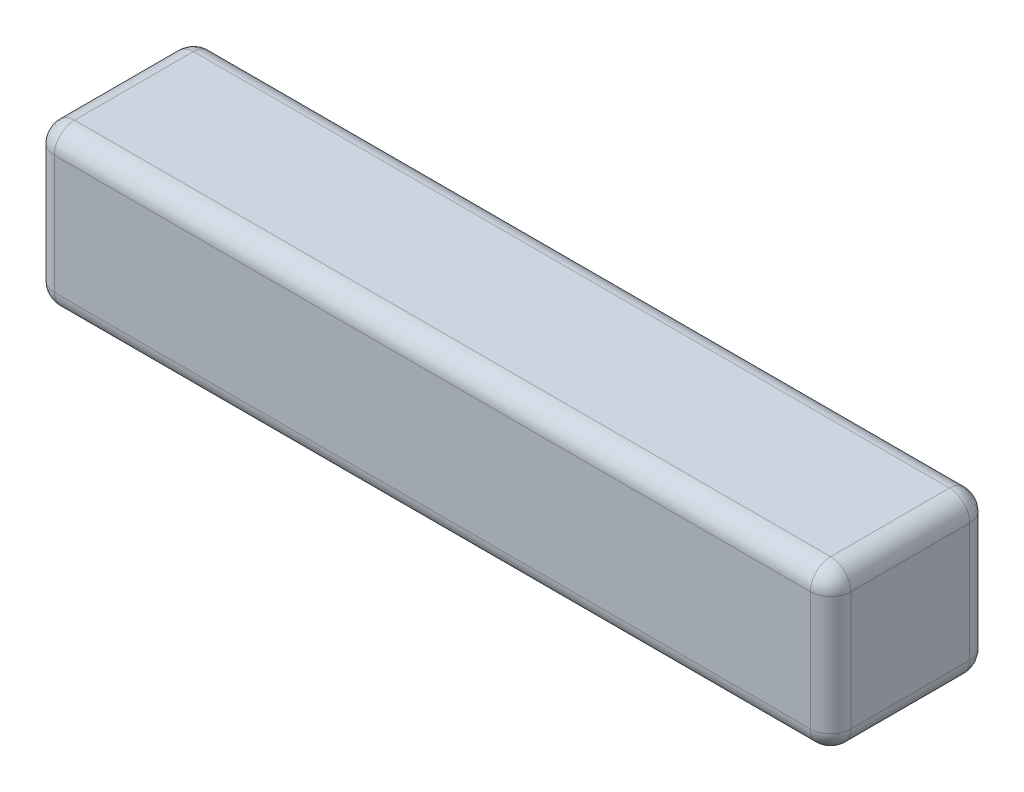
ISO-10303-21;
HEADER;
FILE_DESCRIPTION(('STEP AP214'),'2;1');
FILE_NAME('part.step','',(''),(''),'','','');
FILE_SCHEMA(('AUTOMOTIVE_DESIGN { 1 0 10303 214 1 1 1 1 }'));
ENDSEC;
DATA;
#1=APPLICATION_CONTEXT('core data for automotive mechanical design processes');
#2=APPLICATION_PROTOCOL_DEFINITION('international standard','automotive_design',2000,#1);
#3=PRODUCT_CONTEXT('',#1,'mechanical');
#4=PRODUCT('Part','Part','',(#3));
#5=PRODUCT_RELATED_PRODUCT_CATEGORY('part','',(#4));
#6=PRODUCT_DEFINITION_FORMATION('','',#4);
#7=PRODUCT_DEFINITION_CONTEXT('part definition',#1,'design');
#8=PRODUCT_DEFINITION('design','',#6,#7);
#9=PRODUCT_DEFINITION_SHAPE('','',#8);
#10=(LENGTH_UNIT() NAMED_UNIT(*) SI_UNIT(.MILLI.,.METRE.));
#11=(NAMED_UNIT(*) PLANE_ANGLE_UNIT() SI_UNIT($,.RADIAN.));
#12=(NAMED_UNIT(*) SI_UNIT($,.STERADIAN.) SOLID_ANGLE_UNIT());
#13=UNCERTAINTY_MEASURE_WITH_UNIT(LENGTH_MEASURE(1.E-05),#10,'distance_accuracy_value','');
#14=(GEOMETRIC_REPRESENTATION_CONTEXT(3) GLOBAL_UNCERTAINTY_ASSIGNED_CONTEXT((#13)) GLOBAL_UNIT_ASSIGNED_CONTEXT((#10,
#11,#12)) REPRESENTATION_CONTEXT('',''));
#15=CARTESIAN_POINT('',(0.,0.,0.));
#16=DIRECTION('',(0.,0.,1.));
#17=DIRECTION('',(1.,0.,0.));
#18=AXIS2_PLACEMENT_3D('',#15,#16,#17);
#19=CARTESIAN_POINT('',(9.99999999996,-21.07075011394,-3.746000001));
#20=CARTESIAN_POINT('',(9.99999999996,-20.56275011394,-3.746000001));
#21=CARTESIAN_POINT('',(9.49199999996,-20.56275011394,-3.746000001));
#22=CARTESIAN_POINT('',(9.49199999996,-21.07075011394,-3.746000001));
#23=(BOUNDED_CURVE() B_SPLINE_CURVE(3,(#19,#20,#21,#22),.UNSPECIFIED.,.F.,
.F.) B_SPLINE_CURVE_WITH_KNOTS((4,4),(0.,1.),
.UNSPECIFIED.) CURVE() GEOMETRIC_REPRESENTATION_ITEM() RATIONAL_B_SPLINE_CURVE((1.,
0.333333333333333,0.333333333333333,1.)) REPRESENTATION_ITEM(''));
#24=CARTESIAN_POINT('',(9.74599999996,-21.07075011394,-3.746000001));
#25=DIRECTION('',(-1.,0.,0.));
#26=AXIS1_PLACEMENT('',#24,#25);
#27=SURFACE_OF_REVOLUTION('',#23,#26);
#28=CARTESIAN_POINT('',(9.74599999996,-21.07075011394,-3.74599999846));
#29=DIRECTION('',(0.,0.,-1.));
#30=DIRECTION('',(0.,1.,0.));
#31=AXIS2_PLACEMENT_3D('',#28,#29,#30);
#32=CIRCLE('',#31,0.254000000000001);
#33=CARTESIAN_POINT('',(9.74599999996001,-20.8167501140584,-3.746000000365));
#34=VERTEX_POINT('',#33);
#35=CARTESIAN_POINT('',(9.999999999965,-21.07075011521,-3.74599999973));
#36=VERTEX_POINT('',#35);
#37=EDGE_CURVE('E125',#34,#36,#32,.T.);
#38=ORIENTED_EDGE('',*,*,#37,.T.);
#39=CARTESIAN_POINT('',(9.74599999996,-21.07075011648,-3.746000001));
#40=DIRECTION('',(0.,-1.,0.));
#41=DIRECTION('',(0.,0.,-1.));
#42=AXIS2_PLACEMENT_3D('',#39,#40,#41);
#43=CIRCLE('',#42,0.254);
#44=CARTESIAN_POINT('',(9.74599999996001,-21.0707501161625,-4.00000000075));
#45=VERTEX_POINT('',#44);
#46=EDGE_CURVE('E123',#36,#45,#43,.F.);
#47=ORIENTED_EDGE('',*,*,#46,.T.);
#48=CARTESIAN_POINT('',(9.74599999996,-21.07075011394,-3.746000001));
#49=DIRECTION('',(-1.,0.,0.));
#50=DIRECTION('',(0.,1.,0.));
#51=AXIS2_PLACEMENT_3D('',#48,#49,#50);
#52=CIRCLE('',#51,0.254000000000001);
#53=EDGE_CURVE('E111',#45,#34,#52,.F.);
#54=ORIENTED_EDGE('',*,*,#53,.T.);
#55=EDGE_LOOP('',(#38,#47,#54));
#56=FACE_BOUND('',#55,.T.);
#57=ADVANCED_FACE('F17',(#56),#27,.T.);
#58=CARTESIAN_POINT('',(0.,0.,-4.));
#59=DIRECTION('',(0.,0.,1.));
#60=DIRECTION('',(1.,0.,0.));
#61=AXIS2_PLACEMENT_3D('',#58,#59,#60);
#62=PLANE('',#61);
#63=DIRECTION('',(-1.,0.,0.));
#64=VECTOR('',#63,1.);
#65=CARTESIAN_POINT('',(5.000000000361,-22.56275011444,-4.000000001));
#66=LINE('',#65,#64);
#67=CARTESIAN_POINT('',(9.74599999996001,-22.56275011444,-4.00000000075));
#68=VERTEX_POINT('',#67);
#69=CARTESIAN_POINT('',(0.2540000005715,-22.56275011444,-4.0000000005));
#70=VERTEX_POINT('',#69);
#71=EDGE_CURVE('E345',#68,#70,#66,.T.);
#72=ORIENTED_EDGE('',*,*,#71,.T.);
#73=DIRECTION('',(0.,1.,0.));
#74=VECTOR('',#73,1.);
#75=CARTESIAN_POINT('',(0.254000000762,0.,-4.));
#76=LINE('',#75,#74);
#77=CARTESIAN_POINT('',(0.2540000005715,-21.0707501161625,-4.0000000005));
#78=VERTEX_POINT('',#77);
#79=EDGE_CURVE('E105',#78,#70,#76,.F.);
#80=ORIENTED_EDGE('',*,*,#79,.F.);
#81=DIRECTION('',(1.,0.,0.));
#82=VECTOR('',#81,1.);
#83=CARTESIAN_POINT('',(5.000000000361,-21.07075011648,-4.000000001));
#84=LINE('',#83,#82);
#85=EDGE_CURVE('E114',#78,#45,#84,.T.);
#86=ORIENTED_EDGE('',*,*,#85,.T.);
#87=DIRECTION('',(0.,-1.,0.));
#88=VECTOR('',#87,1.);
#89=CARTESIAN_POINT('',(9.74599999996,-21.81675011546,-4.000000001));
#90=LINE('',#89,#88);
#91=EDGE_CURVE('E133',#45,#68,#90,.T.);
#92=ORIENTED_EDGE('',*,*,#91,.T.);
#93=EDGE_LOOP('',(#72,#80,#86,#92));
#94=FACE_BOUND('',#93,.T.);
#95=ADVANCED_FACE('F139',(#94),#62,.F.);
#96=CARTESIAN_POINT('',(9.74599999996,-22.81675011444,-3.746000001));
#97=CARTESIAN_POINT('',(10.25399999996,-22.81675011444,-3.746000001));
#98=CARTESIAN_POINT('',(10.25399999996,-22.30875011444,-3.746000001));
#99=CARTESIAN_POINT('',(9.74599999996,-22.30875011444,-3.746000001));
#100=(BOUNDED_CURVE() B_SPLINE_CURVE(3,(#96,#97,#98,#99),.UNSPECIFIED.,.F.,
.F.) B_SPLINE_CURVE_WITH_KNOTS((4,4),(0.,1.),
.UNSPECIFIED.) CURVE() GEOMETRIC_REPRESENTATION_ITEM() RATIONAL_B_SPLINE_CURVE((1.,
0.333333333333333,0.333333333333333,1.)) REPRESENTATION_ITEM(''));
#101=CARTESIAN_POINT('',(9.74599999996,-22.56275011444,-3.746000001));
#102=DIRECTION('',(0.,1.,0.));
#103=AXIS1_PLACEMENT('',#101,#102);
#104=SURFACE_OF_REVOLUTION('',#100,#103);
#105=CARTESIAN_POINT('',(9.74599999996,-22.56275011444,-3.74599999846));
#106=DIRECTION('',(0.,0.,1.));
#107=DIRECTION('',(0.,-1.,0.));
#108=AXIS2_PLACEMENT_3D('',#105,#106,#107);
#109=CIRCLE('',#108,0.254000000000001);
#110=CARTESIAN_POINT('',(9.999999999965,-22.56275011444,-3.74599999973));
#111=VERTEX_POINT('',#110);
#112=CARTESIAN_POINT('',(9.74599999996,-22.8167501144959,-3.74599999973));
#113=VERTEX_POINT('',#112);
#114=EDGE_CURVE('E129',#111,#113,#109,.F.);
#115=ORIENTED_EDGE('',*,*,#114,.T.);
#116=CARTESIAN_POINT('',(9.74599999996,-22.56275011444,-3.746000001));
#117=DIRECTION('',(-1.,0.,0.));
#118=DIRECTION('',(0.,0.,-1.));
#119=AXIS2_PLACEMENT_3D('',#116,#117,#118);
#120=CIRCLE('',#119,0.254);
#121=EDGE_CURVE('E340',#113,#68,#120,.F.);
#122=ORIENTED_EDGE('',*,*,#121,.T.);
#123=CARTESIAN_POINT('',(9.74599999996,-22.56275011444,-3.746000001));
#124=DIRECTION('',(0.,-1.,0.));
#125=DIRECTION('',(0.,0.,-1.));
#126=AXIS2_PLACEMENT_3D('',#123,#124,#125);
#127=CIRCLE('',#126,0.254);
#128=EDGE_CURVE('E130',#68,#111,#127,.T.);
#129=ORIENTED_EDGE('',*,*,#128,.T.);
#130=EDGE_LOOP('',(#115,#122,#129));
#131=FACE_BOUND('',#130,.T.);
#132=ADVANCED_FACE('F164',(#131),#104,.T.);
#133=CARTESIAN_POINT('',(0.254,-22.81675011444,-3.746000001));
#134=CARTESIAN_POINT('',(0.254,-22.81675011444,-4.254000001));
#135=CARTESIAN_POINT('',(0.254,-22.30875011444,-4.254000001));
#136=CARTESIAN_POINT('',(0.254,-22.30875011444,-3.746000001));
#137=(BOUNDED_CURVE() B_SPLINE_CURVE(3,(#133,#134,#135,#136),.UNSPECIFIED.,.F.,
.F.) B_SPLINE_CURVE_WITH_KNOTS((4,4),(0.,1.),
.UNSPECIFIED.) CURVE() GEOMETRIC_REPRESENTATION_ITEM() RATIONAL_B_SPLINE_CURVE((1.,
0.333333333333333,0.333333333333333,1.)) REPRESENTATION_ITEM(''));
#138=CARTESIAN_POINT('',(0.254,-22.56275011444,-3.746000001));
#139=DIRECTION('',(0.,1.,0.));
#140=AXIS1_PLACEMENT('',#138,#139);
#141=SURFACE_OF_REVOLUTION('',#137,#140);
#142=CARTESIAN_POINT('',(0.254,-22.56275011444,-3.746000001));
#143=DIRECTION('',(0.,1.,0.));
#144=DIRECTION('',(0.,0.,-1.));
#145=AXIS2_PLACEMENT_3D('',#142,#143,#144);
#146=CIRCLE('',#145,0.254);
#147=CARTESIAN_POINT('',(0.,-22.56275011444,-3.74599999973));
#148=VERTEX_POINT('',#147);
#149=EDGE_CURVE('E329',#148,#70,#146,.F.);
#150=ORIENTED_EDGE('',*,*,#149,.T.);
#151=CARTESIAN_POINT('',(0.254000000762001,-22.56275011444,-3.746000001));
#152=DIRECTION('',(-1.,0.,0.));
#153=DIRECTION('',(0.,0.,-1.));
#154=AXIS2_PLACEMENT_3D('',#151,#152,#153);
#155=CIRCLE('',#154,0.254);
#156=CARTESIAN_POINT('',(0.25400000028575,-22.8167501144959,-3.74599999973));
#157=VERTEX_POINT('',#156);
#158=EDGE_CURVE('E342',#70,#157,#155,.T.);
#159=ORIENTED_EDGE('',*,*,#158,.T.);
#160=CARTESIAN_POINT('',(0.254,-22.56275011444,-3.74599999846));
#161=DIRECTION('',(0.,0.,-1.));
#162=DIRECTION('',(0.,-1.,0.));
#163=AXIS2_PLACEMENT_3D('',#160,#161,#162);
#164=CIRCLE('',#163,0.254000000000001);
#165=EDGE_CURVE('E332',#157,#148,#164,.T.);
#166=ORIENTED_EDGE('',*,*,#165,.T.);
#167=EDGE_LOOP('',(#150,#159,#166));
#168=FACE_BOUND('',#167,.T.);
#169=ADVANCED_FACE('F159',(#168),#141,.T.);
#170=CARTESIAN_POINT('',(0.254,-21.07075011394,-4.000000001));
#171=CARTESIAN_POINT('',(0.254,-20.56275011394,-4.000000001));
#172=CARTESIAN_POINT('',(0.254,-20.56275011394,-3.492000001));
#173=CARTESIAN_POINT('',(0.254,-21.07075011394,-3.492000001));
#174=(BOUNDED_CURVE() B_SPLINE_CURVE(3,(#170,#171,#172,#173),.UNSPECIFIED.,.F.,
.F.) B_SPLINE_CURVE_WITH_KNOTS((4,4),(0.,1.),
.UNSPECIFIED.) CURVE() GEOMETRIC_REPRESENTATION_ITEM() RATIONAL_B_SPLINE_CURVE((1.,
0.333333333333333,0.333333333333333,1.)) REPRESENTATION_ITEM(''));
#175=CARTESIAN_POINT('',(0.254,-21.07075011394,-3.746000001));
#176=DIRECTION('',(0.,0.,1.));
#177=AXIS1_PLACEMENT('',#175,#176);
#178=SURFACE_OF_REVOLUTION('',#174,#177);
#179=CARTESIAN_POINT('',(0.254000000762001,-21.07075011394,-3.746000001));
#180=DIRECTION('',(-1.,0.,0.));
#181=DIRECTION('',(0.,1.,0.));
#182=AXIS2_PLACEMENT_3D('',#179,#180,#181);
#183=CIRCLE('',#182,0.254000000000001);
#184=CARTESIAN_POINT('',(0.2540000001905,-20.8167501140584,-3.7460000006825));
#185=VERTEX_POINT('',#184);
#186=EDGE_CURVE('E121',#185,#78,#183,.T.);
#187=ORIENTED_EDGE('',*,*,#186,.T.);
#188=CARTESIAN_POINT('',(0.254,-21.07075011648,-3.746000001));
#189=DIRECTION('',(0.,1.,0.));
#190=DIRECTION('',(0.,0.,-1.));
#191=AXIS2_PLACEMENT_3D('',#188,#189,#190);
#192=CIRCLE('',#191,0.254);
#193=CARTESIAN_POINT('',(0.,-21.07075011521,-3.746000000365));
#194=VERTEX_POINT('',#193);
#195=EDGE_CURVE('E326',#78,#194,#192,.T.);
#196=ORIENTED_EDGE('',*,*,#195,.T.);
#197=CARTESIAN_POINT('',(0.254,-21.07075011394,-3.746000001));
#198=DIRECTION('',(0.,0.,1.));
#199=DIRECTION('',(0.,1.,0.));
#200=AXIS2_PLACEMENT_3D('',#197,#198,#199);
#201=CIRCLE('',#200,0.254000000000001);
#202=EDGE_CURVE('E337',#194,#185,#201,.F.);
#203=ORIENTED_EDGE('',*,*,#202,.T.);
#204=EDGE_LOOP('',(#187,#196,#203));
#205=FACE_BOUND('',#204,.T.);
#206=ADVANCED_FACE('F155',(#205),#178,.T.);
#207=CARTESIAN_POINT('',(9.74599999996,-21.07075011394,-3.746000001));
#208=DIRECTION('',(-1.,0.,0.));
#209=DIRECTION('',(0.,0.,1.));
#210=AXIS2_PLACEMENT_3D('',#207,#208,#209);
#211=CYLINDRICAL_SURFACE('',#210,0.254000000000001);
#212=DIRECTION('',(1.,0.,0.));
#213=VECTOR('',#212,1.);
#214=CARTESIAN_POINT('',(0.,-20.8167501148869,-3.74599999846));
#215=LINE('',#214,#213);
#216=EDGE_CURVE('E117',#185,#34,#215,.T.);
#217=ORIENTED_EDGE('',*,*,#216,.T.);
#218=ORIENTED_EDGE('',*,*,#53,.F.);
#219=ORIENTED_EDGE('',*,*,#85,.F.);
#220=ORIENTED_EDGE('',*,*,#186,.F.);
#221=EDGE_LOOP('',(#217,#218,#219,#220));
#222=FACE_BOUND('',#221,.T.);
#223=ADVANCED_FACE('F113',(#222),#211,.T.);
#224=CARTESIAN_POINT('',(9.74599999996,-21.07075011394,-2.253999999992));
#225=DIRECTION('',(0.,0.,-1.));
#226=DIRECTION('',(-1.,0.,0.));
#227=AXIS2_PLACEMENT_3D('',#224,#225,#226);
#228=CYLINDRICAL_SURFACE('',#227,0.254000000000001);
#229=DIRECTION('',(0.,0.,-1.));
#230=VECTOR('',#229,1.);
#231=CARTESIAN_POINT('',(10.,-21.07075011648,0.));
#232=LINE('',#231,#230);
#233=CARTESIAN_POINT('',(9.99999999997,-21.0707501161625,-2.25400000027775));
#234=VERTEX_POINT('',#233);
#235=EDGE_CURVE('E313',#234,#36,#232,.T.);
#236=ORIENTED_EDGE('',*,*,#235,.T.);
#237=ORIENTED_EDGE('',*,*,#37,.F.);
#238=DIRECTION('',(0.,0.,-1.));
#239=VECTOR('',#238,1.);
#240=CARTESIAN_POINT('',(9.74599999996,-20.8167501148869,0.));
#241=LINE('',#240,#239);
#242=CARTESIAN_POINT('',(9.74599999996,-20.8167501141767,-2.25400000027775));
#243=VERTEX_POINT('',#242);
#244=EDGE_CURVE('E318',#34,#243,#241,.F.);
#245=ORIENTED_EDGE('',*,*,#244,.T.);
#246=CARTESIAN_POINT('',(9.74599999996,-21.07075011394,-2.253999999992));
#247=DIRECTION('',(0.,0.,-1.));
#248=DIRECTION('',(0.,1.,0.));
#249=AXIS2_PLACEMENT_3D('',#246,#247,#248);
#250=CIRCLE('',#249,0.254000000000001);
#251=EDGE_CURVE('E137',#234,#243,#250,.F.);
#252=ORIENTED_EDGE('',*,*,#251,.F.);
#253=EDGE_LOOP('',(#236,#237,#245,#252));
#254=FACE_BOUND('',#253,.T.);
#255=ADVANCED_FACE('F305',(#254),#228,.T.);
#256=CARTESIAN_POINT('',(9.74599999996,-21.07075011648,-3.746000001));
#257=DIRECTION('',(0.,-1.,0.));
#258=DIRECTION('',(0.,0.,-1.));
#259=AXIS2_PLACEMENT_3D('',#256,#257,#258);
#260=CYLINDRICAL_SURFACE('',#259,0.254);
#261=DIRECTION('',(0.,1.,0.));
#262=VECTOR('',#261,1.);
#263=CARTESIAN_POINT('',(10.,0.,-3.74599999846));
#264=LINE('',#263,#262);
#265=EDGE_CURVE('E317',#36,#111,#264,.F.);
#266=ORIENTED_EDGE('',*,*,#265,.T.);
#267=ORIENTED_EDGE('',*,*,#128,.F.);
#268=ORIENTED_EDGE('',*,*,#91,.F.);
#269=ORIENTED_EDGE('',*,*,#46,.F.);
#270=EDGE_LOOP('',(#266,#267,#268,#269));
#271=FACE_BOUND('',#270,.T.);
#272=ADVANCED_FACE('F134',(#271),#260,.T.);
#273=CARTESIAN_POINT('',(9.74599999996,-22.56275011444,-3.74599999846));
#274=DIRECTION('',(0.,0.,1.));
#275=DIRECTION('',(1.,0.,0.));
#276=AXIS2_PLACEMENT_3D('',#273,#274,#275);
#277=CYLINDRICAL_SURFACE('',#276,0.254000000000001);
#278=DIRECTION('',(0.,0.,1.));
#279=VECTOR('',#278,1.);
#280=CARTESIAN_POINT('',(9.74599999996,-22.8167501148869,0.));
#281=LINE('',#280,#279);
#282=CARTESIAN_POINT('',(9.74599999996,-22.8167501145517,-2.2540000005635));
#283=VERTEX_POINT('',#282);
#284=EDGE_CURVE('E260',#283,#113,#281,.F.);
#285=ORIENTED_EDGE('',*,*,#284,.T.);
#286=ORIENTED_EDGE('',*,*,#114,.F.);
#287=DIRECTION('',(0.,0.,-1.));
#288=VECTOR('',#287,1.);
#289=CARTESIAN_POINT('',(10.,-22.56275011444,0.));
#290=LINE('',#289,#288);
#291=CARTESIAN_POINT('',(9.99999999997,-22.56275011444,-2.25400000065875));
#292=VERTEX_POINT('',#291);
#293=EDGE_CURVE('E263',#111,#292,#290,.F.);
#294=ORIENTED_EDGE('',*,*,#293,.T.);
#295=CARTESIAN_POINT('',(9.74599999996,-22.56275011444,-2.254000000754));
#296=DIRECTION('',(0.,0.,1.));
#297=DIRECTION('',(0.,-1.,0.));
#298=AXIS2_PLACEMENT_3D('',#295,#296,#297);
#299=CIRCLE('',#298,0.254000000000001);
#300=EDGE_CURVE('E347',#283,#292,#299,.T.);
#301=ORIENTED_EDGE('',*,*,#300,.F.);
#302=EDGE_LOOP('',(#285,#286,#294,#301));
#303=FACE_BOUND('',#302,.T.);
#304=ADVANCED_FACE('F299',(#303),#277,.T.);
#305=CARTESIAN_POINT('',(9.74599999996,-22.56275011444,-3.746000001));
#306=DIRECTION('',(-1.,0.,0.));
#307=DIRECTION('',(0.,0.,1.));
#308=AXIS2_PLACEMENT_3D('',#305,#306,#307);
#309=CYLINDRICAL_SURFACE('',#308,0.254);
#310=DIRECTION('',(1.,0.,0.));
#311=VECTOR('',#310,1.);
#312=CARTESIAN_POINT('',(0.,-22.8167501148869,-3.74599999846));
#313=LINE('',#312,#311);
#314=EDGE_CURVE('E257',#113,#157,#313,.F.);
#315=ORIENTED_EDGE('',*,*,#314,.T.);
#316=ORIENTED_EDGE('',*,*,#158,.F.);
#317=ORIENTED_EDGE('',*,*,#71,.F.);
#318=ORIENTED_EDGE('',*,*,#121,.F.);
#319=EDGE_LOOP('',(#315,#316,#317,#318));
#320=FACE_BOUND('',#319,.T.);
#321=ADVANCED_FACE('F295',(#320),#309,.T.);
#322=CARTESIAN_POINT('',(0.254,-21.07075011394,-3.746000001));
#323=DIRECTION('',(0.,0.,1.));
#324=DIRECTION('',(1.,0.,0.));
#325=AXIS2_PLACEMENT_3D('',#322,#323,#324);
#326=CYLINDRICAL_SURFACE('',#325,0.254000000000001);
#327=DIRECTION('',(0.,0.,-1.));
#328=VECTOR('',#327,1.);
#329=CARTESIAN_POINT('',(0.254000000762,-20.8167501148869,0.));
#330=LINE('',#329,#328);
#331=CARTESIAN_POINT('',(0.2540000001905,-20.8167501140584,-2.2540000005635));
#332=VERTEX_POINT('',#331);
#333=EDGE_CURVE('E323',#332,#185,#330,.T.);
#334=ORIENTED_EDGE('',*,*,#333,.T.);
#335=ORIENTED_EDGE('',*,*,#202,.F.);
#336=DIRECTION('',(0.,0.,-1.));
#337=VECTOR('',#336,1.);
#338=CARTESIAN_POINT('',(0.,-21.07075011648,0.));
#339=LINE('',#338,#337);
#340=CARTESIAN_POINT('',(0.,-21.0707501161625,-2.25400000065875));
#341=VERTEX_POINT('',#340);
#342=EDGE_CURVE('E225',#194,#341,#339,.F.);
#343=ORIENTED_EDGE('',*,*,#342,.T.);
#344=CARTESIAN_POINT('',(0.254,-21.07075011394,-2.254000000754));
#345=DIRECTION('',(0.,0.,1.));
#346=DIRECTION('',(0.,1.,0.));
#347=AXIS2_PLACEMENT_3D('',#344,#345,#346);
#348=CIRCLE('',#347,0.254000000000001);
#349=EDGE_CURVE('E335',#332,#341,#348,.T.);
#350=ORIENTED_EDGE('',*,*,#349,.F.);
#351=EDGE_LOOP('',(#334,#335,#343,#350));
#352=FACE_BOUND('',#351,.T.);
#353=ADVANCED_FACE('F291',(#352),#326,.T.);
#354=CARTESIAN_POINT('',(0.254,-22.56275011444,-2.254000000754));
#355=DIRECTION('',(0.,0.,-1.));
#356=DIRECTION('',(-1.,0.,0.));
#357=AXIS2_PLACEMENT_3D('',#354,#355,#356);
#358=CYLINDRICAL_SURFACE('',#357,0.254000000000001);
#359=DIRECTION('',(0.,0.,-1.));
#360=VECTOR('',#359,1.);
#361=CARTESIAN_POINT('',(0.,-22.56275011444,0.));
#362=LINE('',#361,#360);
#363=CARTESIAN_POINT('',(0.,-22.56275011444,-2.2540000005635));
#364=VERTEX_POINT('',#363);
#365=EDGE_CURVE('E222',#364,#148,#362,.T.);
#366=ORIENTED_EDGE('',*,*,#365,.T.);
#367=ORIENTED_EDGE('',*,*,#165,.F.);
#368=DIRECTION('',(0.,0.,1.));
#369=VECTOR('',#368,1.);
#370=CARTESIAN_POINT('',(0.254000000762,-22.8167501148869,0.));
#371=LINE('',#370,#369);
#372=CARTESIAN_POINT('',(0.25400000028575,-22.8167501145517,-2.2540000005635));
#373=VERTEX_POINT('',#372);
#374=EDGE_CURVE('E251',#157,#373,#371,.T.);
#375=ORIENTED_EDGE('',*,*,#374,.T.);
#376=CARTESIAN_POINT('',(0.254,-22.56275011444,-2.253999999992));
#377=DIRECTION('',(0.,0.,-1.));
#378=DIRECTION('',(-1.,0.,0.));
#379=AXIS2_PLACEMENT_3D('',#376,#377,#378);
#380=CIRCLE('',#379,0.254000000000001);
#381=EDGE_CURVE('E228',#373,#364,#380,.T.);
#382=ORIENTED_EDGE('',*,*,#381,.T.);
#383=EDGE_LOOP('',(#366,#367,#375,#382));
#384=FACE_BOUND('',#383,.T.);
#385=ADVANCED_FACE('F287',(#384),#358,.T.);
#386=CARTESIAN_POINT('',(0.254,-22.56275011444,-3.746000001));
#387=DIRECTION('',(0.,1.,0.));
#388=DIRECTION('',(0.,0.,1.));
#389=AXIS2_PLACEMENT_3D('',#386,#387,#388);
#390=CYLINDRICAL_SURFACE('',#389,0.254);
#391=ORIENTED_EDGE('',*,*,#79,.T.);
#392=ORIENTED_EDGE('',*,*,#149,.F.);
#393=DIRECTION('',(0.,1.,0.));
#394=VECTOR('',#393,1.);
#395=CARTESIAN_POINT('',(0.,0.,-3.74599999846));
#396=LINE('',#395,#394);
#397=EDGE_CURVE('E216',#148,#194,#396,.T.);
#398=ORIENTED_EDGE('',*,*,#397,.T.);
#399=ORIENTED_EDGE('',*,*,#195,.F.);
#400=EDGE_LOOP('',(#391,#392,#398,#399));
#401=FACE_BOUND('',#400,.T.);
#402=ADVANCED_FACE('F283',(#401),#390,.T.);
#403=CARTESIAN_POINT('',(0.,-20.8167501148869,0.));
#404=DIRECTION('',(0.,-1.,0.));
#405=DIRECTION('',(0.,0.,-1.));
#406=AXIS2_PLACEMENT_3D('',#403,#404,#405);
#407=PLANE('',#406);
#408=ORIENTED_EDGE('',*,*,#216,.F.);
#409=ORIENTED_EDGE('',*,*,#333,.F.);
#410=DIRECTION('',(1.,0.,0.));
#411=VECTOR('',#410,1.);
#412=CARTESIAN_POINT('',(5.000000000361,-20.81675011394,-2.254000000754));
#413=LINE('',#412,#411);
#414=EDGE_CURVE('E364',#332,#243,#413,.T.);
#415=ORIENTED_EDGE('',*,*,#414,.T.);
#416=ORIENTED_EDGE('',*,*,#244,.F.);
#417=EDGE_LOOP('',(#408,#409,#415,#416));
#418=FACE_BOUND('',#417,.T.);
#419=ADVANCED_FACE('F279',(#418),#407,.F.);
#420=CARTESIAN_POINT('',(10.,0.,0.));
#421=DIRECTION('',(1.,0.,0.));
#422=DIRECTION('',(0.,0.,-1.));
#423=AXIS2_PLACEMENT_3D('',#420,#421,#422);
#424=PLANE('',#423);
#425=ORIENTED_EDGE('',*,*,#265,.F.);
#426=ORIENTED_EDGE('',*,*,#235,.F.);
#427=DIRECTION('',(0.,-1.,0.));
#428=VECTOR('',#427,1.);
#429=CARTESIAN_POINT('',(9.99999999996,-21.81675011546,-2.254000000754));
#430=LINE('',#429,#428);
#431=EDGE_CURVE('E367',#234,#292,#430,.T.);
#432=ORIENTED_EDGE('',*,*,#431,.T.);
#433=ORIENTED_EDGE('',*,*,#293,.F.);
#434=EDGE_LOOP('',(#425,#426,#432,#433));
#435=FACE_BOUND('',#434,.T.);
#436=ADVANCED_FACE('F275',(#435),#424,.T.);
#437=CARTESIAN_POINT('',(9.74599999996,-21.07075011394,-1.999999999992));
#438=CARTESIAN_POINT('',(9.74599999996,-20.56275011394,-1.999999999992));
#439=CARTESIAN_POINT('',(9.74599999996,-20.56275011394,-2.507999999992));
#440=CARTESIAN_POINT('',(9.74599999996,-21.07075011394,-2.507999999992));
#441=(BOUNDED_CURVE() B_SPLINE_CURVE(3,(#437,#438,#439,#440),.UNSPECIFIED.,.F.,
.F.) B_SPLINE_CURVE_WITH_KNOTS((4,4),(0.,1.),
.UNSPECIFIED.) CURVE() GEOMETRIC_REPRESENTATION_ITEM() RATIONAL_B_SPLINE_CURVE((1.,
0.333333333333333,0.333333333333333,1.)) REPRESENTATION_ITEM(''));
#442=CARTESIAN_POINT('',(9.74599999996,-21.07075011394,-2.253999999992));
#443=DIRECTION('',(0.,0.,-1.));
#444=AXIS1_PLACEMENT('',#442,#443);
#445=SURFACE_OF_REVOLUTION('',#441,#444);
#446=CARTESIAN_POINT('',(9.74599999996,-21.07075011394,-2.253999999992));
#447=DIRECTION('',(-1.,0.,0.));
#448=DIRECTION('',(0.,0.,1.));
#449=AXIS2_PLACEMENT_3D('',#446,#447,#448);
#450=CIRCLE('',#449,0.254);
#451=CARTESIAN_POINT('',(9.74599999996,-21.070750114575,-1.999999999993));
#452=VERTEX_POINT('',#451);
#453=EDGE_CURVE('E365',#243,#452,#450,.F.);
#454=ORIENTED_EDGE('',*,*,#453,.T.);
#455=CARTESIAN_POINT('',(9.74599999996,-21.07075011648,-2.253999999992));
#456=DIRECTION('',(0.,1.,0.));
#457=DIRECTION('',(0.,0.,1.));
#458=AXIS2_PLACEMENT_3D('',#455,#456,#457);
#459=CIRCLE('',#458,0.254);
#460=EDGE_CURVE('E374',#452,#234,#459,.T.);
#461=ORIENTED_EDGE('',*,*,#460,.T.);
#462=ORIENTED_EDGE('',*,*,#251,.T.);
#463=EDGE_LOOP('',(#454,#461,#462));
#464=FACE_BOUND('',#463,.T.);
#465=ADVANCED_FACE('F272',(#464),#445,.T.);
#466=CARTESIAN_POINT('',(0.,-22.8167501148869,0.));
#467=DIRECTION('',(0.,1.,0.));
#468=DIRECTION('',(0.,0.,1.));
#469=AXIS2_PLACEMENT_3D('',#466,#467,#468);
#470=PLANE('',#469);
#471=ORIENTED_EDGE('',*,*,#314,.F.);
#472=ORIENTED_EDGE('',*,*,#284,.F.);
#473=DIRECTION('',(-1.,0.,0.));
#474=VECTOR('',#473,1.);
#475=CARTESIAN_POINT('',(5.000000000361,-22.81675011444,-2.253999999992));
#476=LINE('',#475,#474);
#477=EDGE_CURVE('E377',#283,#373,#476,.T.);
#478=ORIENTED_EDGE('',*,*,#477,.T.);
#479=ORIENTED_EDGE('',*,*,#374,.F.);
#480=EDGE_LOOP('',(#471,#472,#478,#479));
#481=FACE_BOUND('',#480,.T.);
#482=ADVANCED_FACE('F244',(#481),#470,.F.);
#483=CARTESIAN_POINT('',(9.74599999996,-22.81675011444,-2.253999999992));
#484=CARTESIAN_POINT('',(9.74599999996,-22.81675011444,-1.745999999992));
#485=CARTESIAN_POINT('',(9.74599999996,-22.30875011444,-1.745999999992));
#486=CARTESIAN_POINT('',(9.74599999996,-22.30875011444,-2.253999999992));
#487=(BOUNDED_CURVE() B_SPLINE_CURVE(3,(#483,#484,#485,#486),.UNSPECIFIED.,.F.,
.F.) B_SPLINE_CURVE_WITH_KNOTS((4,4),(0.,1.),
.UNSPECIFIED.) CURVE() GEOMETRIC_REPRESENTATION_ITEM() RATIONAL_B_SPLINE_CURVE((1.,
0.333333333333333,0.333333333333333,1.)) REPRESENTATION_ITEM(''));
#488=CARTESIAN_POINT('',(9.74599999996,-22.56275011444,-2.253999999992));
#489=DIRECTION('',(0.,1.,0.));
#490=AXIS1_PLACEMENT('',#488,#489);
#491=SURFACE_OF_REVOLUTION('',#487,#490);
#492=CARTESIAN_POINT('',(9.74599999996,-22.56275011444,-2.253999999992));
#493=DIRECTION('',(-1.,0.,0.));
#494=DIRECTION('',(0.,-1.,0.));
#495=AXIS2_PLACEMENT_3D('',#492,#493,#494);
#496=CIRCLE('',#495,0.254000000000001);
#497=CARTESIAN_POINT('',(9.74599999996,-22.56275011444,-1.999999999993));
#498=VERTEX_POINT('',#497);
#499=EDGE_CURVE('E382',#498,#283,#496,.F.);
#500=ORIENTED_EDGE('',*,*,#499,.T.);
#501=ORIENTED_EDGE('',*,*,#300,.T.);
#502=CARTESIAN_POINT('',(9.74599999996,-22.56275011444,-2.253999999992));
#503=DIRECTION('',(0.,1.,0.));
#504=DIRECTION('',(0.,0.,1.));
#505=AXIS2_PLACEMENT_3D('',#502,#503,#504);
#506=CIRCLE('',#505,0.254);
#507=EDGE_CURVE('E371',#292,#498,#506,.F.);
#508=ORIENTED_EDGE('',*,*,#507,.T.);
#509=EDGE_LOOP('',(#500,#501,#508));
#510=FACE_BOUND('',#509,.T.);
#511=ADVANCED_FACE('F240',(#510),#491,.T.);
#512=CARTESIAN_POINT('',(0.254,-22.81675011444,-2.253999999992));
#513=CARTESIAN_POINT('',(-0.254000000000001,-22.81675011444,-2.253999999992));
#514=CARTESIAN_POINT('',(-0.254000000000001,-22.30875011444,-2.253999999992));
#515=CARTESIAN_POINT('',(0.254,-22.30875011444,-2.253999999992));
#516=(BOUNDED_CURVE() B_SPLINE_CURVE(3,(#512,#513,#514,#515),.UNSPECIFIED.,.F.,
.F.) B_SPLINE_CURVE_WITH_KNOTS((4,4),(0.,1.),
.UNSPECIFIED.) CURVE() GEOMETRIC_REPRESENTATION_ITEM() RATIONAL_B_SPLINE_CURVE((1.,
0.333333333333333,0.333333333333333,1.)) REPRESENTATION_ITEM(''));
#517=CARTESIAN_POINT('',(0.254,-22.56275011444,-2.253999999992));
#518=DIRECTION('',(0.,1.,0.));
#519=AXIS1_PLACEMENT('',#517,#518);
#520=SURFACE_OF_REVOLUTION('',#516,#519);
#521=CARTESIAN_POINT('',(0.254,-22.56275011444,-2.253999999992));
#522=DIRECTION('',(0.,-1.,0.));
#523=DIRECTION('',(0.,0.,1.));
#524=AXIS2_PLACEMENT_3D('',#521,#522,#523);
#525=CIRCLE('',#524,0.254);
#526=CARTESIAN_POINT('',(0.25400000028575,-22.56275011444,-1.999999999993));
#527=VERTEX_POINT('',#526);
#528=EDGE_CURVE('E36',#527,#364,#525,.T.);
#529=ORIENTED_EDGE('',*,*,#528,.T.);
#530=ORIENTED_EDGE('',*,*,#381,.F.);
#531=CARTESIAN_POINT('',(0.254000000762001,-22.56275011444,-2.253999999992));
#532=DIRECTION('',(-1.,0.,0.));
#533=DIRECTION('',(0.,-1.,0.));
#534=AXIS2_PLACEMENT_3D('',#531,#532,#533);
#535=CIRCLE('',#534,0.254000000000001);
#536=EDGE_CURVE('E380',#373,#527,#535,.T.);
#537=ORIENTED_EDGE('',*,*,#536,.T.);
#538=EDGE_LOOP('',(#529,#530,#537));
#539=FACE_BOUND('',#538,.T.);
#540=ADVANCED_FACE('F237',(#539),#520,.T.);
#541=CARTESIAN_POINT('',(0.,0.,0.));
#542=DIRECTION('',(1.,0.,0.));
#543=DIRECTION('',(0.,0.,-1.));
#544=AXIS2_PLACEMENT_3D('',#541,#542,#543);
#545=PLANE('',#544);
#546=ORIENTED_EDGE('',*,*,#365,.F.);
#547=DIRECTION('',(0.,1.,0.));
#548=VECTOR('',#547,1.);
#549=CARTESIAN_POINT('',(0.,-21.81675011419,-2.254000000754));
#550=LINE('',#549,#548);
#551=EDGE_CURVE('E386',#364,#341,#550,.T.);
#552=ORIENTED_EDGE('',*,*,#551,.T.);
#553=ORIENTED_EDGE('',*,*,#342,.F.);
#554=ORIENTED_EDGE('',*,*,#397,.F.);
#555=EDGE_LOOP('',(#546,#552,#553,#554));
#556=FACE_BOUND('',#555,.T.);
#557=ADVANCED_FACE('F206',(#556),#545,.F.);
#558=CARTESIAN_POINT('',(0.,-21.07075011394,-2.253999999992));
#559=CARTESIAN_POINT('',(0.,-20.56275011394,-2.253999999992));
#560=CARTESIAN_POINT('',(0.508,-20.56275011394,-2.253999999992));
#561=CARTESIAN_POINT('',(0.508,-21.07075011394,-2.253999999992));
#562=(BOUNDED_CURVE() B_SPLINE_CURVE(3,(#558,#559,#560,#561),.UNSPECIFIED.,.F.,
.F.) B_SPLINE_CURVE_WITH_KNOTS((4,4),(0.,1.),
.UNSPECIFIED.) CURVE() GEOMETRIC_REPRESENTATION_ITEM() RATIONAL_B_SPLINE_CURVE((1.,
0.333333333333333,0.333333333333333,1.)) REPRESENTATION_ITEM(''));
#563=CARTESIAN_POINT('',(0.254,-21.07075011394,-2.253999999992));
#564=DIRECTION('',(1.,0.,0.));
#565=AXIS1_PLACEMENT('',#563,#564);
#566=SURFACE_OF_REVOLUTION('',#562,#565);
#567=CARTESIAN_POINT('',(0.254000000762001,-21.07075011394,-2.253999999992));
#568=DIRECTION('',(-1.,0.,0.));
#569=DIRECTION('',(0.,0.,1.));
#570=AXIS2_PLACEMENT_3D('',#567,#568,#569);
#571=CIRCLE('',#570,0.254);
#572=CARTESIAN_POINT('',(0.25400000028575,-21.070750114575,-1.999999999993));
#573=VERTEX_POINT('',#572);
#574=EDGE_CURVE('E214',#573,#332,#571,.T.);
#575=ORIENTED_EDGE('',*,*,#574,.T.);
#576=ORIENTED_EDGE('',*,*,#349,.T.);
#577=CARTESIAN_POINT('',(0.254,-21.07075011648,-2.253999999992));
#578=DIRECTION('',(0.,-1.,0.));
#579=DIRECTION('',(0.,0.,1.));
#580=AXIS2_PLACEMENT_3D('',#577,#578,#579);
#581=CIRCLE('',#580,0.254);
#582=EDGE_CURVE('E361',#341,#573,#581,.F.);
#583=ORIENTED_EDGE('',*,*,#582,.T.);
#584=EDGE_LOOP('',(#575,#576,#583));
#585=FACE_BOUND('',#584,.T.);
#586=ADVANCED_FACE('F201',(#585),#566,.T.);
#587=CARTESIAN_POINT('',(9.74599999996,-21.07075011394,-2.253999999992));
#588=DIRECTION('',(-1.,0.,0.));
#589=DIRECTION('',(0.,0.,1.));
#590=AXIS2_PLACEMENT_3D('',#587,#588,#589);
#591=CYLINDRICAL_SURFACE('',#590,0.254);
#592=ORIENTED_EDGE('',*,*,#414,.F.);
#593=ORIENTED_EDGE('',*,*,#574,.F.);
#594=DIRECTION('',(-1.,0.,0.));
#595=VECTOR('',#594,1.);
#596=CARTESIAN_POINT('',(0.,-21.07075011648,-2.));
#597=LINE('',#596,#595);
#598=EDGE_CURVE('E390',#573,#452,#597,.F.);
#599=ORIENTED_EDGE('',*,*,#598,.T.);
#600=ORIENTED_EDGE('',*,*,#453,.F.);
#601=EDGE_LOOP('',(#592,#593,#599,#600));
#602=FACE_BOUND('',#601,.T.);
#603=ADVANCED_FACE('F197',(#602),#591,.T.);
#604=CARTESIAN_POINT('',(9.74599999996,-22.56275011444,-2.253999999992));
#605=DIRECTION('',(0.,1.,0.));
#606=DIRECTION('',(0.,0.,1.));
#607=AXIS2_PLACEMENT_3D('',#604,#605,#606);
#608=CYLINDRICAL_SURFACE('',#607,0.254);
#609=DIRECTION('',(0.,1.,0.));
#610=VECTOR('',#609,1.);
#611=CARTESIAN_POINT('',(9.74599999996,0.,-2.));
#612=LINE('',#611,#610);
#613=EDGE_CURVE('E392',#452,#498,#612,.F.);
#614=ORIENTED_EDGE('',*,*,#613,.T.);
#615=ORIENTED_EDGE('',*,*,#507,.F.);
#616=ORIENTED_EDGE('',*,*,#431,.F.);
#617=ORIENTED_EDGE('',*,*,#460,.F.);
#618=EDGE_LOOP('',(#614,#615,#616,#617));
#619=FACE_BOUND('',#618,.T.);
#620=ADVANCED_FACE('F193',(#619),#608,.T.);
#621=CARTESIAN_POINT('',(9.74599999996,-22.56275011444,-2.253999999992));
#622=DIRECTION('',(-1.,0.,0.));
#623=DIRECTION('',(0.,0.,1.));
#624=AXIS2_PLACEMENT_3D('',#621,#622,#623);
#625=CYLINDRICAL_SURFACE('',#624,0.254000000000001);
#626=DIRECTION('',(-1.,0.,0.));
#627=VECTOR('',#626,1.);
#628=CARTESIAN_POINT('',(0.,-22.56275011444,-2.));
#629=LINE('',#628,#627);
#630=EDGE_CURVE('E28',#498,#527,#629,.T.);
#631=ORIENTED_EDGE('',*,*,#630,.T.);
#632=ORIENTED_EDGE('',*,*,#536,.F.);
#633=ORIENTED_EDGE('',*,*,#477,.F.);
#634=ORIENTED_EDGE('',*,*,#499,.F.);
#635=EDGE_LOOP('',(#631,#632,#633,#634));
#636=FACE_BOUND('',#635,.T.);
#637=ADVANCED_FACE('F187',(#636),#625,.T.);
#638=CARTESIAN_POINT('',(0.254,-21.07075011394,-2.253999999992));
#639=DIRECTION('',(0.,-1.,0.));
#640=DIRECTION('',(0.,0.,-1.));
#641=AXIS2_PLACEMENT_3D('',#638,#639,#640);
#642=CYLINDRICAL_SURFACE('',#641,0.254);
#643=ORIENTED_EDGE('',*,*,#551,.F.);
#644=ORIENTED_EDGE('',*,*,#528,.F.);
#645=DIRECTION('',(0.,1.,0.));
#646=VECTOR('',#645,1.);
#647=CARTESIAN_POINT('',(0.254000000762,0.,-2.));
#648=LINE('',#647,#646);
#649=EDGE_CURVE('E11',#527,#573,#648,.T.);
#650=ORIENTED_EDGE('',*,*,#649,.T.);
#651=ORIENTED_EDGE('',*,*,#582,.F.);
#652=EDGE_LOOP('',(#643,#644,#650,#651));
#653=FACE_BOUND('',#652,.T.);
#654=ADVANCED_FACE('F181',(#653),#642,.T.);
#655=CARTESIAN_POINT('',(0.,0.,-2.));
#656=DIRECTION('',(0.,0.,-1.));
#657=DIRECTION('',(-1.,0.,0.));
#658=AXIS2_PLACEMENT_3D('',#655,#656,#657);
#659=PLANE('',#658);
#660=ORIENTED_EDGE('',*,*,#630,.F.);
#661=ORIENTED_EDGE('',*,*,#613,.F.);
#662=ORIENTED_EDGE('',*,*,#598,.F.);
#663=ORIENTED_EDGE('',*,*,#649,.F.);
#664=EDGE_LOOP('',(#660,#661,#662,#663));
#665=FACE_BOUND('',#664,.T.);
#666=ADVANCED_FACE('F179',(#665),#659,.F.);
#667=CLOSED_SHELL('',(#57,#95,#132,#169,#206,#223,#255,#272,#304,#321,#353,#385,#402,#419,#436,
#465,#482,#511,#540,#557,#586,#603,#620,#637,#654,#666));
#668=MANIFOLD_SOLID_BREP('B1',#667);
#669=ADVANCED_BREP_SHAPE_REPRESENTATION('',(#18,#668),#14);
#670=SHAPE_DEFINITION_REPRESENTATION(#9,#669);
ENDSEC;
END-ISO-10303-21;
